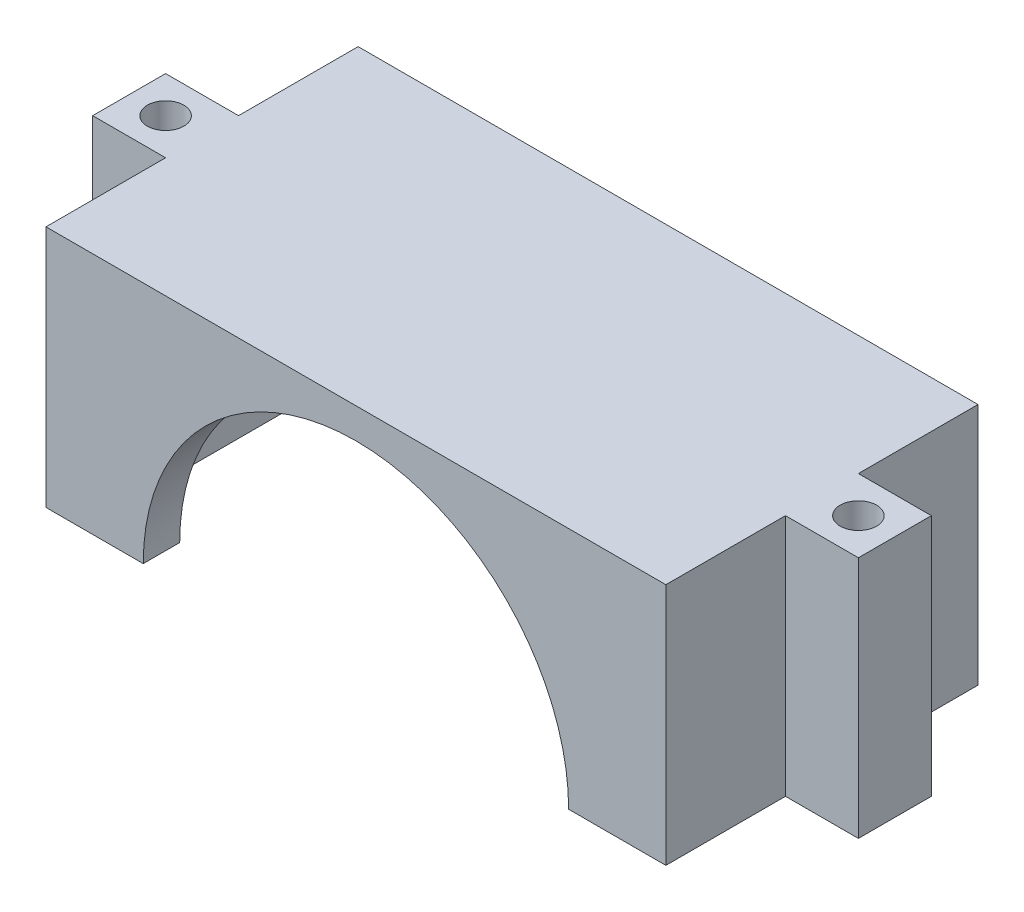
ISO-10303-21;
HEADER;
FILE_DESCRIPTION(('STEP AP214'),'2;1');
FILE_NAME('part.step','',(''),(''),'','','');
FILE_SCHEMA(('AUTOMOTIVE_DESIGN { 1 0 10303 214 1 1 1 1 }'));
ENDSEC;
DATA;
#1=APPLICATION_CONTEXT('core data for automotive mechanical design processes');
#2=APPLICATION_PROTOCOL_DEFINITION('international standard','automotive_design',2000,#1);
#3=PRODUCT_CONTEXT('',#1,'mechanical');
#4=PRODUCT('Part','Part','',(#3));
#5=PRODUCT_RELATED_PRODUCT_CATEGORY('part','',(#4));
#6=PRODUCT_DEFINITION_FORMATION('','',#4);
#7=PRODUCT_DEFINITION_CONTEXT('part definition',#1,'design');
#8=PRODUCT_DEFINITION('design','',#6,#7);
#9=PRODUCT_DEFINITION_SHAPE('','',#8);
#10=(LENGTH_UNIT() NAMED_UNIT(*) SI_UNIT(.MILLI.,.METRE.));
#11=(NAMED_UNIT(*) PLANE_ANGLE_UNIT() SI_UNIT($,.RADIAN.));
#12=(NAMED_UNIT(*) SI_UNIT($,.STERADIAN.) SOLID_ANGLE_UNIT());
#13=UNCERTAINTY_MEASURE_WITH_UNIT(LENGTH_MEASURE(1.E-05),#10,'distance_accuracy_value','');
#14=(GEOMETRIC_REPRESENTATION_CONTEXT(3) GLOBAL_UNCERTAINTY_ASSIGNED_CONTEXT((#13)) GLOBAL_UNIT_ASSIGNED_CONTEXT((#10,
#11,#12)) REPRESENTATION_CONTEXT('',''));
#15=CARTESIAN_POINT('',(0.,0.,0.));
#16=DIRECTION('',(0.,0.,1.));
#17=DIRECTION('',(1.,0.,0.));
#18=AXIS2_PLACEMENT_3D('',#15,#16,#17);
#19=CARTESIAN_POINT('',(-25.5,20.,12.84));
#20=DIRECTION('',(1.,0.,0.));
#21=DIRECTION('',(0.,0.,-1.));
#22=AXIS2_PLACEMENT_3D('',#19,#20,#21);
#23=PLANE('',#22);
#24=DIRECTION('',(0.,-1.,0.));
#25=VECTOR('',#24,1.);
#26=CARTESIAN_POINT('',(-25.5,20.,-3.00000000000001));
#27=LINE('',#26,#25);
#28=CARTESIAN_POINT('',(-25.5,20.,-3.00000000000001));
#29=VERTEX_POINT('',#28);
#30=CARTESIAN_POINT('',(-25.5,0.,-3.00000000000001));
#31=VERTEX_POINT('',#30);
#32=EDGE_CURVE('E303',#29,#31,#27,.T.);
#33=ORIENTED_EDGE('',*,*,#32,.F.);
#34=DIRECTION('',(0.,0.,1.));
#35=VECTOR('',#34,1.);
#36=CARTESIAN_POINT('',(-25.5,20.,12.84));
#37=LINE('',#36,#35);
#38=CARTESIAN_POINT('',(-25.5,20.,-12.84));
#39=VERTEX_POINT('',#38);
#40=EDGE_CURVE('E210',#39,#29,#37,.T.);
#41=ORIENTED_EDGE('',*,*,#40,.F.);
#42=DIRECTION('',(0.,-1.,0.));
#43=VECTOR('',#42,1.);
#44=CARTESIAN_POINT('',(-25.5,20.,-12.84));
#45=LINE('',#44,#43);
#46=CARTESIAN_POINT('',(-25.5,0.,-12.84));
#47=VERTEX_POINT('',#46);
#48=EDGE_CURVE('E41',#39,#47,#45,.T.);
#49=ORIENTED_EDGE('',*,*,#48,.T.);
#50=DIRECTION('',(0.,0.,1.));
#51=VECTOR('',#50,1.);
#52=CARTESIAN_POINT('',(-25.5,0.,12.84));
#53=LINE('',#52,#51);
#54=EDGE_CURVE('E254',#47,#31,#53,.T.);
#55=ORIENTED_EDGE('',*,*,#54,.T.);
#56=EDGE_LOOP('',(#33,#41,#49,#55));
#57=FACE_BOUND('',#56,.T.);
#58=ADVANCED_FACE('F32',(#57),#23,.F.);
#59=CARTESIAN_POINT('',(25.5,20.,12.84));
#60=DIRECTION('',(-1.,0.,0.));
#61=DIRECTION('',(0.,0.,1.));
#62=AXIS2_PLACEMENT_3D('',#59,#60,#61);
#63=PLANE('',#62);
#64=DIRECTION('',(0.,-1.,0.));
#65=VECTOR('',#64,1.);
#66=CARTESIAN_POINT('',(25.5,20.,3.));
#67=LINE('',#66,#65);
#68=CARTESIAN_POINT('',(25.5,20.,3.));
#69=VERTEX_POINT('',#68);
#70=CARTESIAN_POINT('',(25.5,0.,3.));
#71=VERTEX_POINT('',#70);
#72=EDGE_CURVE('E270',#69,#71,#67,.T.);
#73=ORIENTED_EDGE('',*,*,#72,.F.);
#74=DIRECTION('',(0.,0.,-1.));
#75=VECTOR('',#74,1.);
#76=CARTESIAN_POINT('',(25.5,20.,12.84));
#77=LINE('',#76,#75);
#78=CARTESIAN_POINT('',(25.5,20.,12.84));
#79=VERTEX_POINT('',#78);
#80=EDGE_CURVE('E216',#79,#69,#77,.T.);
#81=ORIENTED_EDGE('',*,*,#80,.F.);
#82=DIRECTION('',(0.,-1.,0.));
#83=VECTOR('',#82,1.);
#84=CARTESIAN_POINT('',(25.5,20.,12.84));
#85=LINE('',#84,#83);
#86=CARTESIAN_POINT('',(25.5,0.,12.84));
#87=VERTEX_POINT('',#86);
#88=EDGE_CURVE('E227',#79,#87,#85,.T.);
#89=ORIENTED_EDGE('',*,*,#88,.T.);
#90=DIRECTION('',(0.,0.,-1.));
#91=VECTOR('',#90,1.);
#92=CARTESIAN_POINT('',(25.5,0.,12.84));
#93=LINE('',#92,#91);
#94=EDGE_CURVE('E237',#87,#71,#93,.T.);
#95=ORIENTED_EDGE('',*,*,#94,.T.);
#96=EDGE_LOOP('',(#73,#81,#89,#95));
#97=FACE_BOUND('',#96,.T.);
#98=ADVANCED_FACE('F421',(#97),#63,.F.);
#99=CARTESIAN_POINT('',(0.,0.,0.));
#100=DIRECTION('',(0.,-1.,0.));
#101=DIRECTION('',(0.,0.,-1.));
#102=AXIS2_PLACEMENT_3D('',#99,#100,#101);
#103=PLANE('',#102);
#104=DIRECTION('',(0.,0.,-1.));
#105=VECTOR('',#104,1.);
#106=CARTESIAN_POINT('',(22.,0.,1.8219037896906));
#107=LINE('',#106,#105);
#108=CARTESIAN_POINT('',(22.,0.,-9.84));
#109=VERTEX_POINT('',#108);
#110=CARTESIAN_POINT('',(22.,0.,-12.84));
#111=VERTEX_POINT('',#110);
#112=EDGE_CURVE('E437',#109,#111,#107,.T.);
#113=ORIENTED_EDGE('',*,*,#112,.T.);
#114=DIRECTION('',(-1.,0.,0.));
#115=VECTOR('',#114,1.);
#116=CARTESIAN_POINT('',(-25.5,0.,-12.84));
#117=LINE('',#116,#115);
#118=CARTESIAN_POINT('',(25.5,0.,-12.84));
#119=VERTEX_POINT('',#118);
#120=EDGE_CURVE('E230',#119,#111,#117,.T.);
#121=ORIENTED_EDGE('',*,*,#120,.F.);
#122=CARTESIAN_POINT('',(25.5,0.,-3.));
#123=VERTEX_POINT('',#122);
#124=EDGE_CURVE('E234',#123,#119,#93,.T.);
#125=ORIENTED_EDGE('',*,*,#124,.F.);
#126=DIRECTION('',(1.,0.,0.));
#127=VECTOR('',#126,1.);
#128=CARTESIAN_POINT('',(25.5,0.,-3.));
#129=LINE('',#128,#127);
#130=CARTESIAN_POINT('',(31.5,0.,-3.));
#131=VERTEX_POINT('',#130);
#132=EDGE_CURVE('E57',#123,#131,#129,.T.);
#133=ORIENTED_EDGE('',*,*,#132,.T.);
#134=DIRECTION('',(0.,0.,1.));
#135=VECTOR('',#134,1.);
#136=CARTESIAN_POINT('',(31.5,0.,-3.));
#137=LINE('',#136,#135);
#138=CARTESIAN_POINT('',(31.5,0.,3.));
#139=VERTEX_POINT('',#138);
#140=EDGE_CURVE('E263',#131,#139,#137,.T.);
#141=ORIENTED_EDGE('',*,*,#140,.T.);
#142=DIRECTION('',(-1.,0.,0.));
#143=VECTOR('',#142,1.);
#144=CARTESIAN_POINT('',(25.5,0.,3.));
#145=LINE('',#144,#143);
#146=EDGE_CURVE('E259',#139,#71,#145,.T.);
#147=ORIENTED_EDGE('',*,*,#146,.T.);
#148=ORIENTED_EDGE('',*,*,#94,.F.);
#149=DIRECTION('',(1.,0.,0.));
#150=VECTOR('',#149,1.);
#151=CARTESIAN_POINT('',(-25.5,0.,12.84));
#152=LINE('',#151,#150);
#153=CARTESIAN_POINT('',(17.5,0.,12.84));
#154=VERTEX_POINT('',#153);
#155=EDGE_CURVE('E249',#154,#87,#152,.T.);
#156=ORIENTED_EDGE('',*,*,#155,.F.);
#157=DIRECTION('',(0.,0.,1.));
#158=VECTOR('',#157,1.);
#159=CARTESIAN_POINT('',(17.5,0.,-29.2911896062463));
#160=LINE('',#159,#158);
#161=CARTESIAN_POINT('',(17.5,0.,9.84));
#162=VERTEX_POINT('',#161);
#163=EDGE_CURVE('E372',#162,#154,#160,.T.);
#164=ORIENTED_EDGE('',*,*,#163,.F.);
#165=DIRECTION('',(-1.,0.,0.));
#166=VECTOR('',#165,1.);
#167=CARTESIAN_POINT('',(-22.5,0.,9.84));
#168=LINE('',#167,#166);
#169=CARTESIAN_POINT('',(22.5,0.,9.84));
#170=VERTEX_POINT('',#169);
#171=EDGE_CURVE('E398',#170,#162,#168,.T.);
#172=ORIENTED_EDGE('',*,*,#171,.F.);
#173=DIRECTION('',(0.,0.,1.));
#174=VECTOR('',#173,1.);
#175=CARTESIAN_POINT('',(22.5,0.,-9.84));
#176=LINE('',#175,#174);
#177=CARTESIAN_POINT('',(22.5,0.,-9.84));
#178=VERTEX_POINT('',#177);
#179=EDGE_CURVE('E395',#178,#170,#176,.T.);
#180=ORIENTED_EDGE('',*,*,#179,.F.);
#181=DIRECTION('',(1.,0.,0.));
#182=VECTOR('',#181,1.);
#183=CARTESIAN_POINT('',(-22.5,0.,-9.84));
#184=LINE('',#183,#182);
#185=EDGE_CURVE('E404',#109,#178,#184,.T.);
#186=ORIENTED_EDGE('',*,*,#185,.F.);
#187=EDGE_LOOP('',(#113,#121,#125,#133,#141,#147,#148,#156,#164,#172,#180,#186));
#188=FACE_BOUND('',#187,.T.);
#189=CARTESIAN_POINT('',(28.5,0.,0.));
#190=DIRECTION('',(0.,-1.,0.));
#191=DIRECTION('',(0.,0.,-1.));
#192=AXIS2_PLACEMENT_3D('',#189,#190,#191);
#193=CIRCLE('',#192,1.5);
#194=CARTESIAN_POINT('',(28.5,0.,-1.49999999999999));
#195=VERTEX_POINT('',#194);
#196=EDGE_CURVE('E299',#195,#195,#193,.T.);
#197=ORIENTED_EDGE('',*,*,#196,.F.);
#198=EDGE_LOOP('',(#197));
#199=FACE_BOUND('',#198,.T.);
#200=ADVANCED_FACE('F429',(#188,#199),#103,.T.);
#201=CARTESIAN_POINT('',(-22.5,17.5,9.84));
#202=DIRECTION('',(0.,0.,1.));
#203=DIRECTION('',(1.,0.,0.));
#204=AXIS2_PLACEMENT_3D('',#201,#202,#203);
#205=PLANE('',#204);
#206=ORIENTED_EDGE('',*,*,#171,.T.);
#207=CARTESIAN_POINT('',(0.,0.,9.84));
#208=DIRECTION('',(0.,0.,1.));
#209=DIRECTION('',(1.,0.,0.));
#210=AXIS2_PLACEMENT_3D('',#207,#208,#209);
#211=CIRCLE('',#210,17.5);
#212=CARTESIAN_POINT('',(0.,17.5,9.84));
#213=VERTEX_POINT('',#212);
#214=EDGE_CURVE('E375',#213,#162,#211,.F.);
#215=ORIENTED_EDGE('',*,*,#214,.F.);
#216=DIRECTION('',(-1.,0.,0.));
#217=VECTOR('',#216,1.);
#218=CARTESIAN_POINT('',(-22.5,17.5,9.84));
#219=LINE('',#218,#217);
#220=CARTESIAN_POINT('',(22.5,17.5,9.84));
#221=VERTEX_POINT('',#220);
#222=EDGE_CURVE('E385',#221,#213,#219,.T.);
#223=ORIENTED_EDGE('',*,*,#222,.F.);
#224=DIRECTION('',(0.,-1.,0.));
#225=VECTOR('',#224,1.);
#226=CARTESIAN_POINT('',(22.5,17.5,9.84));
#227=LINE('',#226,#225);
#228=EDGE_CURVE('E394',#221,#170,#227,.T.);
#229=ORIENTED_EDGE('',*,*,#228,.T.);
#230=EDGE_LOOP('',(#206,#215,#223,#229));
#231=FACE_BOUND('',#230,.T.);
#232=ADVANCED_FACE('F457',(#231),#205,.F.);
#233=CARTESIAN_POINT('',(25.5,20.,-3.));
#234=VERTEX_POINT('',#233);
#235=CARTESIAN_POINT('',(25.5,20.,-12.84));
#236=VERTEX_POINT('',#235);
#237=EDGE_CURVE('E248',#234,#236,#77,.T.);
#238=ORIENTED_EDGE('',*,*,#237,.F.);
#239=DIRECTION('',(0.,-1.,0.));
#240=VECTOR('',#239,1.);
#241=CARTESIAN_POINT('',(25.5,20.,-3.));
#242=LINE('',#241,#240);
#243=EDGE_CURVE('E268',#234,#123,#242,.T.);
#244=ORIENTED_EDGE('',*,*,#243,.T.);
#245=ORIENTED_EDGE('',*,*,#124,.T.);
#246=DIRECTION('',(0.,-1.,0.));
#247=VECTOR('',#246,1.);
#248=CARTESIAN_POINT('',(25.5,20.,-12.84));
#249=LINE('',#248,#247);
#250=EDGE_CURVE('E11',#236,#119,#249,.T.);
#251=ORIENTED_EDGE('',*,*,#250,.F.);
#252=EDGE_LOOP('',(#238,#244,#245,#251));
#253=FACE_BOUND('',#252,.T.);
#254=ADVANCED_FACE('F34',(#253),#63,.F.);
#255=CARTESIAN_POINT('',(-25.5,20.,-12.84));
#256=DIRECTION('',(0.,0.,1.));
#257=DIRECTION('',(1.,0.,0.));
#258=AXIS2_PLACEMENT_3D('',#255,#256,#257);
#259=PLANE('',#258);
#260=ORIENTED_EDGE('',*,*,#120,.T.);
#261=DIRECTION('',(0.,-1.,0.));
#262=VECTOR('',#261,1.);
#263=CARTESIAN_POINT('',(22.,0.,-12.84));
#264=LINE('',#263,#262);
#265=CARTESIAN_POINT('',(22.,6.,-12.84));
#266=VERTEX_POINT('',#265);
#267=EDGE_CURVE('E273',#266,#111,#264,.T.);
#268=ORIENTED_EDGE('',*,*,#267,.F.);
#269=DIRECTION('',(1.,0.,0.));
#270=VECTOR('',#269,1.);
#271=CARTESIAN_POINT('',(22.,6.,-12.84));
#272=LINE('',#271,#270);
#273=CARTESIAN_POINT('',(12.,6.,-12.84));
#274=VERTEX_POINT('',#273);
#275=EDGE_CURVE('E441',#274,#266,#272,.T.);
#276=ORIENTED_EDGE('',*,*,#275,.F.);
#277=DIRECTION('',(0.,1.,0.));
#278=VECTOR('',#277,1.);
#279=CARTESIAN_POINT('',(12.,0.,-12.84));
#280=LINE('',#279,#278);
#281=CARTESIAN_POINT('',(12.,0.,-12.84));
#282=VERTEX_POINT('',#281);
#283=EDGE_CURVE('E446',#282,#274,#280,.T.);
#284=ORIENTED_EDGE('',*,*,#283,.F.);
#285=EDGE_CURVE('E239',#282,#47,#117,.T.);
#286=ORIENTED_EDGE('',*,*,#285,.T.);
#287=ORIENTED_EDGE('',*,*,#48,.F.);
#288=DIRECTION('',(-1.,0.,0.));
#289=VECTOR('',#288,1.);
#290=CARTESIAN_POINT('',(-25.5,20.,-12.84));
#291=LINE('',#290,#289);
#292=EDGE_CURVE('E211',#236,#39,#291,.T.);
#293=ORIENTED_EDGE('',*,*,#292,.F.);
#294=ORIENTED_EDGE('',*,*,#250,.T.);
#295=EDGE_LOOP('',(#260,#268,#276,#284,#286,#287,#293,#294));
#296=FACE_BOUND('',#295,.T.);
#297=ADVANCED_FACE('F352',(#296),#259,.F.);
#298=CARTESIAN_POINT('',(-25.5,20.,2.99999999999999));
#299=VERTEX_POINT('',#298);
#300=CARTESIAN_POINT('',(-25.5,20.,12.84));
#301=VERTEX_POINT('',#300);
#302=EDGE_CURVE('E199',#299,#301,#37,.T.);
#303=ORIENTED_EDGE('',*,*,#302,.F.);
#304=DIRECTION('',(0.,-1.,0.));
#305=VECTOR('',#304,1.);
#306=CARTESIAN_POINT('',(-25.5,20.,2.99999999999999));
#307=LINE('',#306,#305);
#308=CARTESIAN_POINT('',(-25.5,0.,2.99999999999999));
#309=VERTEX_POINT('',#308);
#310=EDGE_CURVE('E184',#299,#309,#307,.T.);
#311=ORIENTED_EDGE('',*,*,#310,.T.);
#312=CARTESIAN_POINT('',(-25.5,0.,12.84));
#313=VERTEX_POINT('',#312);
#314=EDGE_CURVE('E252',#309,#313,#53,.T.);
#315=ORIENTED_EDGE('',*,*,#314,.T.);
#316=DIRECTION('',(0.,-1.,0.));
#317=VECTOR('',#316,1.);
#318=CARTESIAN_POINT('',(-25.5,20.,12.84));
#319=LINE('',#318,#317);
#320=EDGE_CURVE('E208',#301,#313,#319,.T.);
#321=ORIENTED_EDGE('',*,*,#320,.F.);
#322=EDGE_LOOP('',(#303,#311,#315,#321));
#323=FACE_BOUND('',#322,.T.);
#324=ADVANCED_FACE('F206',(#323),#23,.F.);
#325=CARTESIAN_POINT('',(-25.5,20.,12.84));
#326=DIRECTION('',(0.,0.,-1.));
#327=DIRECTION('',(-1.,0.,0.));
#328=AXIS2_PLACEMENT_3D('',#325,#326,#327);
#329=PLANE('',#328);
#330=CARTESIAN_POINT('',(-17.5,0.,12.84));
#331=VERTEX_POINT('',#330);
#332=EDGE_CURVE('E246',#313,#331,#152,.T.);
#333=ORIENTED_EDGE('',*,*,#332,.T.);
#334=CARTESIAN_POINT('',(0.,0.,12.84));
#335=DIRECTION('',(0.,0.,1.));
#336=DIRECTION('',(1.,0.,0.));
#337=AXIS2_PLACEMENT_3D('',#334,#335,#336);
#338=CIRCLE('',#337,17.5);
#339=EDGE_CURVE('E373',#154,#331,#338,.T.);
#340=ORIENTED_EDGE('',*,*,#339,.F.);
#341=ORIENTED_EDGE('',*,*,#155,.T.);
#342=ORIENTED_EDGE('',*,*,#88,.F.);
#343=DIRECTION('',(1.,0.,0.));
#344=VECTOR('',#343,1.);
#345=CARTESIAN_POINT('',(-25.5,20.,12.84));
#346=LINE('',#345,#344);
#347=EDGE_CURVE('E214',#301,#79,#346,.T.);
#348=ORIENTED_EDGE('',*,*,#347,.F.);
#349=ORIENTED_EDGE('',*,*,#320,.T.);
#350=EDGE_LOOP('',(#333,#340,#341,#342,#348,#349));
#351=FACE_BOUND('',#350,.T.);
#352=ADVANCED_FACE('F362',(#351),#329,.F.);
#353=CARTESIAN_POINT('',(0.,20.,0.));
#354=DIRECTION('',(0.,-1.,0.));
#355=DIRECTION('',(0.,0.,-1.));
#356=AXIS2_PLACEMENT_3D('',#353,#354,#355);
#357=PLANE('',#356);
#358=ORIENTED_EDGE('',*,*,#80,.T.);
#359=DIRECTION('',(-1.,0.,0.));
#360=VECTOR('',#359,1.);
#361=CARTESIAN_POINT('',(25.5,20.,3.));
#362=LINE('',#361,#360);
#363=CARTESIAN_POINT('',(31.5,20.,3.));
#364=VERTEX_POINT('',#363);
#365=EDGE_CURVE('E266',#364,#69,#362,.T.);
#366=ORIENTED_EDGE('',*,*,#365,.F.);
#367=DIRECTION('',(0.,0.,1.));
#368=VECTOR('',#367,1.);
#369=CARTESIAN_POINT('',(31.5,20.,-3.));
#370=LINE('',#369,#368);
#371=CARTESIAN_POINT('',(31.5,20.,-3.));
#372=VERTEX_POINT('',#371);
#373=EDGE_CURVE('E269',#372,#364,#370,.T.);
#374=ORIENTED_EDGE('',*,*,#373,.F.);
#375=DIRECTION('',(1.,0.,0.));
#376=VECTOR('',#375,1.);
#377=CARTESIAN_POINT('',(25.5,20.,-3.));
#378=LINE('',#377,#376);
#379=EDGE_CURVE('E262',#234,#372,#378,.T.);
#380=ORIENTED_EDGE('',*,*,#379,.F.);
#381=ORIENTED_EDGE('',*,*,#237,.T.);
#382=ORIENTED_EDGE('',*,*,#292,.T.);
#383=ORIENTED_EDGE('',*,*,#40,.T.);
#384=DIRECTION('',(1.,0.,0.));
#385=VECTOR('',#384,1.);
#386=CARTESIAN_POINT('',(-25.5,20.,-3.00000000000001));
#387=LINE('',#386,#385);
#388=CARTESIAN_POINT('',(-31.5,20.,-3.00000000000001));
#389=VERTEX_POINT('',#388);
#390=EDGE_CURVE('E192',#389,#29,#387,.T.);
#391=ORIENTED_EDGE('',*,*,#390,.F.);
#392=DIRECTION('',(0.,0.,-1.));
#393=VECTOR('',#392,1.);
#394=CARTESIAN_POINT('',(-31.5,20.,-3.00000000000001));
#395=LINE('',#394,#393);
#396=CARTESIAN_POINT('',(-31.5,20.,2.99999999999999));
#397=VERTEX_POINT('',#396);
#398=EDGE_CURVE('E203',#397,#389,#395,.T.);
#399=ORIENTED_EDGE('',*,*,#398,.F.);
#400=DIRECTION('',(-1.,0.,0.));
#401=VECTOR('',#400,1.);
#402=CARTESIAN_POINT('',(-25.5,20.,2.99999999999999));
#403=LINE('',#402,#401);
#404=EDGE_CURVE('E187',#299,#397,#403,.T.);
#405=ORIENTED_EDGE('',*,*,#404,.F.);
#406=ORIENTED_EDGE('',*,*,#302,.T.);
#407=ORIENTED_EDGE('',*,*,#347,.T.);
#408=EDGE_LOOP('',(#358,#366,#374,#380,#381,#382,#383,#391,#399,#405,#406,#407));
#409=FACE_BOUND('',#408,.T.);
#410=CARTESIAN_POINT('',(28.5,20.,0.));
#411=DIRECTION('',(0.,-1.,0.));
#412=DIRECTION('',(0.,0.,-1.));
#413=AXIS2_PLACEMENT_3D('',#410,#411,#412);
#414=CIRCLE('',#413,1.5);
#415=CARTESIAN_POINT('',(28.5,20.,-1.49999999999999));
#416=VERTEX_POINT('',#415);
#417=EDGE_CURVE('E302',#416,#416,#414,.T.);
#418=ORIENTED_EDGE('',*,*,#417,.T.);
#419=EDGE_LOOP('',(#418));
#420=FACE_BOUND('',#419,.T.);
#421=CARTESIAN_POINT('',(-28.5,20.,0.));
#422=DIRECTION('',(0.,-1.,0.));
#423=DIRECTION('',(0.,0.,1.));
#424=AXIS2_PLACEMENT_3D('',#421,#422,#423);
#425=CIRCLE('',#424,1.5);
#426=CARTESIAN_POINT('',(-28.5,20.,1.5));
#427=VERTEX_POINT('',#426);
#428=EDGE_CURVE('E332',#427,#427,#425,.T.);
#429=ORIENTED_EDGE('',*,*,#428,.T.);
#430=EDGE_LOOP('',(#429));
#431=FACE_BOUND('',#430,.T.);
#432=ADVANCED_FACE('F197',(#409,#420,#431),#357,.F.);
#433=DIRECTION('',(0.,0.,-1.));
#434=VECTOR('',#433,1.);
#435=CARTESIAN_POINT('',(12.,0.,1.8219037896906));
#436=LINE('',#435,#434);
#437=CARTESIAN_POINT('',(12.,0.,-9.84));
#438=VERTEX_POINT('',#437);
#439=EDGE_CURVE('E357',#438,#282,#436,.T.);
#440=ORIENTED_EDGE('',*,*,#439,.F.);
#441=CARTESIAN_POINT('',(-22.5,0.,-9.84));
#442=VERTEX_POINT('',#441);
#443=EDGE_CURVE('E384',#442,#438,#184,.T.);
#444=ORIENTED_EDGE('',*,*,#443,.F.);
#445=DIRECTION('',(0.,0.,-1.));
#446=VECTOR('',#445,1.);
#447=CARTESIAN_POINT('',(-22.5,0.,-9.84));
#448=LINE('',#447,#446);
#449=CARTESIAN_POINT('',(-22.5,0.,9.84));
#450=VERTEX_POINT('',#449);
#451=EDGE_CURVE('E401',#450,#442,#448,.T.);
#452=ORIENTED_EDGE('',*,*,#451,.F.);
#453=CARTESIAN_POINT('',(-17.5,0.,9.84));
#454=VERTEX_POINT('',#453);
#455=EDGE_CURVE('E369',#454,#450,#168,.T.);
#456=ORIENTED_EDGE('',*,*,#455,.F.);
#457=DIRECTION('',(0.,0.,1.));
#458=VECTOR('',#457,1.);
#459=CARTESIAN_POINT('',(-17.5,0.,-29.2911896062463));
#460=LINE('',#459,#458);
#461=EDGE_CURVE('E367',#454,#331,#460,.T.);
#462=ORIENTED_EDGE('',*,*,#461,.T.);
#463=ORIENTED_EDGE('',*,*,#332,.F.);
#464=ORIENTED_EDGE('',*,*,#314,.F.);
#465=DIRECTION('',(-1.,0.,0.));
#466=VECTOR('',#465,1.);
#467=CARTESIAN_POINT('',(-25.5,0.,2.99999999999999));
#468=LINE('',#467,#466);
#469=CARTESIAN_POINT('',(-31.5,0.,2.99999999999999));
#470=VERTEX_POINT('',#469);
#471=EDGE_CURVE('E49',#309,#470,#468,.T.);
#472=ORIENTED_EDGE('',*,*,#471,.T.);
#473=DIRECTION('',(0.,0.,-1.));
#474=VECTOR('',#473,1.);
#475=CARTESIAN_POINT('',(-31.5,0.,-3.00000000000001));
#476=LINE('',#475,#474);
#477=CARTESIAN_POINT('',(-31.5,0.,-3.00000000000001));
#478=VERTEX_POINT('',#477);
#479=EDGE_CURVE('E319',#470,#478,#476,.T.);
#480=ORIENTED_EDGE('',*,*,#479,.T.);
#481=DIRECTION('',(1.,0.,0.));
#482=VECTOR('',#481,1.);
#483=CARTESIAN_POINT('',(-25.5,0.,-3.00000000000001));
#484=LINE('',#483,#482);
#485=EDGE_CURVE('E204',#478,#31,#484,.T.);
#486=ORIENTED_EDGE('',*,*,#485,.T.);
#487=ORIENTED_EDGE('',*,*,#54,.F.);
#488=ORIENTED_EDGE('',*,*,#285,.F.);
#489=EDGE_LOOP('',(#440,#444,#452,#456,#462,#463,#464,#472,#480,#486,#487,#488));
#490=FACE_BOUND('',#489,.T.);
#491=CARTESIAN_POINT('',(-28.5,0.,0.));
#492=DIRECTION('',(0.,-1.,0.));
#493=DIRECTION('',(0.,0.,1.));
#494=AXIS2_PLACEMENT_3D('',#491,#492,#493);
#495=CIRCLE('',#494,1.5);
#496=CARTESIAN_POINT('',(-28.5,0.,1.5));
#497=VERTEX_POINT('',#496);
#498=EDGE_CURVE('E334',#497,#497,#495,.T.);
#499=ORIENTED_EDGE('',*,*,#498,.F.);
#500=EDGE_LOOP('',(#499));
#501=FACE_BOUND('',#500,.T.);
#502=ADVANCED_FACE('F329',(#490,#501),#103,.T.);
#503=CARTESIAN_POINT('',(22.5,17.5,-9.84));
#504=DIRECTION('',(1.,0.,0.));
#505=DIRECTION('',(0.,0.,-1.));
#506=AXIS2_PLACEMENT_3D('',#503,#504,#505);
#507=PLANE('',#506);
#508=ORIENTED_EDGE('',*,*,#179,.T.);
#509=ORIENTED_EDGE('',*,*,#228,.F.);
#510=DIRECTION('',(0.,0.,1.));
#511=VECTOR('',#510,1.);
#512=CARTESIAN_POINT('',(22.5,17.5,-9.84));
#513=LINE('',#512,#511);
#514=CARTESIAN_POINT('',(22.5,17.5,-9.84));
#515=VERTEX_POINT('',#514);
#516=EDGE_CURVE('E380',#515,#221,#513,.T.);
#517=ORIENTED_EDGE('',*,*,#516,.F.);
#518=DIRECTION('',(0.,-1.,0.));
#519=VECTOR('',#518,1.);
#520=CARTESIAN_POINT('',(22.5,17.5,-9.84));
#521=LINE('',#520,#519);
#522=EDGE_CURVE('E406',#515,#178,#521,.T.);
#523=ORIENTED_EDGE('',*,*,#522,.T.);
#524=EDGE_LOOP('',(#508,#509,#517,#523));
#525=FACE_BOUND('',#524,.T.);
#526=ADVANCED_FACE('F460',(#525),#507,.F.);
#527=CARTESIAN_POINT('',(-22.5,17.5,-9.84));
#528=DIRECTION('',(0.,0.,-1.));
#529=DIRECTION('',(-1.,0.,0.));
#530=AXIS2_PLACEMENT_3D('',#527,#528,#529);
#531=PLANE('',#530);
#532=DIRECTION('',(-1.,0.,0.));
#533=VECTOR('',#532,1.);
#534=CARTESIAN_POINT('',(22.,6.,-9.84));
#535=LINE('',#534,#533);
#536=CARTESIAN_POINT('',(22.,6.,-9.84));
#537=VERTEX_POINT('',#536);
#538=CARTESIAN_POINT('',(12.,6.,-9.84));
#539=VERTEX_POINT('',#538);
#540=EDGE_CURVE('E467',#537,#539,#535,.T.);
#541=ORIENTED_EDGE('',*,*,#540,.F.);
#542=DIRECTION('',(0.,1.,0.));
#543=VECTOR('',#542,1.);
#544=CARTESIAN_POINT('',(22.,0.,-9.84));
#545=LINE('',#544,#543);
#546=EDGE_CURVE('E377',#109,#537,#545,.T.);
#547=ORIENTED_EDGE('',*,*,#546,.F.);
#548=ORIENTED_EDGE('',*,*,#185,.T.);
#549=ORIENTED_EDGE('',*,*,#522,.F.);
#550=DIRECTION('',(1.,0.,0.));
#551=VECTOR('',#550,1.);
#552=CARTESIAN_POINT('',(-22.5,17.5,-9.84));
#553=LINE('',#552,#551);
#554=CARTESIAN_POINT('',(-22.5,17.5,-9.84));
#555=VERTEX_POINT('',#554);
#556=EDGE_CURVE('E391',#555,#515,#553,.T.);
#557=ORIENTED_EDGE('',*,*,#556,.F.);
#558=DIRECTION('',(0.,-1.,0.));
#559=VECTOR('',#558,1.);
#560=CARTESIAN_POINT('',(-22.5,17.5,-9.84));
#561=LINE('',#560,#559);
#562=EDGE_CURVE('E409',#555,#442,#561,.T.);
#563=ORIENTED_EDGE('',*,*,#562,.T.);
#564=ORIENTED_EDGE('',*,*,#443,.T.);
#565=DIRECTION('',(0.,-1.,0.));
#566=VECTOR('',#565,1.);
#567=CARTESIAN_POINT('',(12.,0.,-9.84));
#568=LINE('',#567,#566);
#569=EDGE_CURVE('E286',#539,#438,#568,.T.);
#570=ORIENTED_EDGE('',*,*,#569,.F.);
#571=EDGE_LOOP('',(#541,#547,#548,#549,#557,#563,#564,#570));
#572=FACE_BOUND('',#571,.T.);
#573=ADVANCED_FACE('F464',(#572),#531,.F.);
#574=CARTESIAN_POINT('',(-22.5,17.5,-9.84));
#575=DIRECTION('',(-1.,0.,0.));
#576=DIRECTION('',(0.,0.,1.));
#577=AXIS2_PLACEMENT_3D('',#574,#575,#576);
#578=PLANE('',#577);
#579=ORIENTED_EDGE('',*,*,#451,.T.);
#580=ORIENTED_EDGE('',*,*,#562,.F.);
#581=DIRECTION('',(0.,0.,-1.));
#582=VECTOR('',#581,1.);
#583=CARTESIAN_POINT('',(-22.5,17.5,-9.84));
#584=LINE('',#583,#582);
#585=CARTESIAN_POINT('',(-22.5,17.5,9.84));
#586=VERTEX_POINT('',#585);
#587=EDGE_CURVE('E388',#586,#555,#584,.T.);
#588=ORIENTED_EDGE('',*,*,#587,.F.);
#589=DIRECTION('',(0.,-1.,0.));
#590=VECTOR('',#589,1.);
#591=CARTESIAN_POINT('',(-22.5,17.5,9.84));
#592=LINE('',#591,#590);
#593=EDGE_CURVE('E411',#586,#450,#592,.T.);
#594=ORIENTED_EDGE('',*,*,#593,.T.);
#595=EDGE_LOOP('',(#579,#580,#588,#594));
#596=FACE_BOUND('',#595,.T.);
#597=ADVANCED_FACE('F517',(#596),#578,.F.);
#598=EDGE_CURVE('E383',#213,#586,#219,.T.);
#599=ORIENTED_EDGE('',*,*,#598,.F.);
#600=EDGE_CURVE('E397',#454,#213,#211,.F.);
#601=ORIENTED_EDGE('',*,*,#600,.F.);
#602=ORIENTED_EDGE('',*,*,#455,.T.);
#603=ORIENTED_EDGE('',*,*,#593,.F.);
#604=EDGE_LOOP('',(#599,#601,#602,#603));
#605=FACE_BOUND('',#604,.T.);
#606=ADVANCED_FACE('F509',(#605),#205,.F.);
#607=CARTESIAN_POINT('',(0.,17.5,0.));
#608=DIRECTION('',(0.,1.,0.));
#609=DIRECTION('',(0.,0.,1.));
#610=AXIS2_PLACEMENT_3D('',#607,#608,#609);
#611=PLANE('',#610);
#612=ORIENTED_EDGE('',*,*,#516,.T.);
#613=ORIENTED_EDGE('',*,*,#222,.T.);
#614=ORIENTED_EDGE('',*,*,#598,.T.);
#615=ORIENTED_EDGE('',*,*,#587,.T.);
#616=ORIENTED_EDGE('',*,*,#556,.T.);
#617=EDGE_LOOP('',(#612,#613,#614,#615,#616));
#618=FACE_BOUND('',#617,.T.);
#619=ADVANCED_FACE('F488',(#618),#611,.F.);
#620=CARTESIAN_POINT('',(0.,0.,-29.2911896062463));
#621=DIRECTION('',(0.,0.,1.));
#622=DIRECTION('',(1.,0.,0.));
#623=AXIS2_PLACEMENT_3D('',#620,#621,#622);
#624=CYLINDRICAL_SURFACE('',#623,17.5);
#625=ORIENTED_EDGE('',*,*,#600,.T.);
#626=ORIENTED_EDGE('',*,*,#214,.T.);
#627=ORIENTED_EDGE('',*,*,#163,.T.);
#628=ORIENTED_EDGE('',*,*,#339,.T.);
#629=ORIENTED_EDGE('',*,*,#461,.F.);
#630=EDGE_LOOP('',(#625,#626,#627,#628,#629));
#631=FACE_BOUND('',#630,.T.);
#632=ADVANCED_FACE('F452',(#631),#624,.F.);
#633=CARTESIAN_POINT('',(22.,0.,1.8219037896906));
#634=DIRECTION('',(1.,0.,0.));
#635=DIRECTION('',(0.,0.,-1.));
#636=AXIS2_PLACEMENT_3D('',#633,#634,#635);
#637=PLANE('',#636);
#638=ORIENTED_EDGE('',*,*,#546,.T.);
#639=DIRECTION('',(0.,0.,-1.));
#640=VECTOR('',#639,1.);
#641=CARTESIAN_POINT('',(22.,6.,1.8219037896906));
#642=LINE('',#641,#640);
#643=EDGE_CURVE('E474',#537,#266,#642,.T.);
#644=ORIENTED_EDGE('',*,*,#643,.T.);
#645=ORIENTED_EDGE('',*,*,#267,.T.);
#646=ORIENTED_EDGE('',*,*,#112,.F.);
#647=EDGE_LOOP('',(#638,#644,#645,#646));
#648=FACE_BOUND('',#647,.T.);
#649=ADVANCED_FACE('F480',(#648),#637,.F.);
#650=CARTESIAN_POINT('',(22.,6.,1.8219037896906));
#651=DIRECTION('',(0.,1.,0.));
#652=DIRECTION('',(0.,0.,1.));
#653=AXIS2_PLACEMENT_3D('',#650,#651,#652);
#654=PLANE('',#653);
#655=ORIENTED_EDGE('',*,*,#540,.T.);
#656=DIRECTION('',(0.,0.,-1.));
#657=VECTOR('',#656,1.);
#658=CARTESIAN_POINT('',(12.,6.,1.8219037896906));
#659=LINE('',#658,#657);
#660=EDGE_CURVE('E443',#539,#274,#659,.T.);
#661=ORIENTED_EDGE('',*,*,#660,.T.);
#662=ORIENTED_EDGE('',*,*,#275,.T.);
#663=ORIENTED_EDGE('',*,*,#643,.F.);
#664=EDGE_LOOP('',(#655,#661,#662,#663));
#665=FACE_BOUND('',#664,.T.);
#666=ADVANCED_FACE('F476',(#665),#654,.F.);
#667=CARTESIAN_POINT('',(12.,0.,1.8219037896906));
#668=DIRECTION('',(-1.,0.,0.));
#669=DIRECTION('',(0.,0.,1.));
#670=AXIS2_PLACEMENT_3D('',#667,#668,#669);
#671=PLANE('',#670);
#672=ORIENTED_EDGE('',*,*,#569,.T.);
#673=ORIENTED_EDGE('',*,*,#439,.T.);
#674=ORIENTED_EDGE('',*,*,#283,.T.);
#675=ORIENTED_EDGE('',*,*,#660,.F.);
#676=EDGE_LOOP('',(#672,#673,#674,#675));
#677=FACE_BOUND('',#676,.T.);
#678=ADVANCED_FACE('F479',(#677),#671,.F.);
#679=CARTESIAN_POINT('',(25.5,20.,3.));
#680=DIRECTION('',(0.,0.,1.));
#681=DIRECTION('',(1.,0.,0.));
#682=AXIS2_PLACEMENT_3D('',#679,#680,#681);
#683=PLANE('',#682);
#684=ORIENTED_EDGE('',*,*,#146,.F.);
#685=DIRECTION('',(0.,-1.,0.));
#686=VECTOR('',#685,1.);
#687=CARTESIAN_POINT('',(31.5,20.,3.));
#688=LINE('',#687,#686);
#689=EDGE_CURVE('E274',#364,#139,#688,.T.);
#690=ORIENTED_EDGE('',*,*,#689,.F.);
#691=ORIENTED_EDGE('',*,*,#365,.T.);
#692=ORIENTED_EDGE('',*,*,#72,.T.);
#693=EDGE_LOOP('',(#684,#690,#691,#692));
#694=FACE_BOUND('',#693,.T.);
#695=ADVANCED_FACE('F425',(#694),#683,.T.);
#696=CARTESIAN_POINT('',(31.5,20.,-3.));
#697=DIRECTION('',(1.,0.,0.));
#698=DIRECTION('',(0.,0.,-1.));
#699=AXIS2_PLACEMENT_3D('',#696,#697,#698);
#700=PLANE('',#699);
#701=ORIENTED_EDGE('',*,*,#140,.F.);
#702=DIRECTION('',(0.,-1.,0.));
#703=VECTOR('',#702,1.);
#704=CARTESIAN_POINT('',(31.5,20.,-3.));
#705=LINE('',#704,#703);
#706=EDGE_CURVE('E282',#372,#131,#705,.T.);
#707=ORIENTED_EDGE('',*,*,#706,.F.);
#708=ORIENTED_EDGE('',*,*,#373,.T.);
#709=ORIENTED_EDGE('',*,*,#689,.T.);
#710=EDGE_LOOP('',(#701,#707,#708,#709));
#711=FACE_BOUND('',#710,.T.);
#712=ADVANCED_FACE('F434',(#711),#700,.T.);
#713=CARTESIAN_POINT('',(25.5,20.,-3.));
#714=DIRECTION('',(0.,0.,-1.));
#715=DIRECTION('',(-1.,0.,0.));
#716=AXIS2_PLACEMENT_3D('',#713,#714,#715);
#717=PLANE('',#716);
#718=ORIENTED_EDGE('',*,*,#132,.F.);
#719=ORIENTED_EDGE('',*,*,#243,.F.);
#720=ORIENTED_EDGE('',*,*,#379,.T.);
#721=ORIENTED_EDGE('',*,*,#706,.T.);
#722=EDGE_LOOP('',(#718,#719,#720,#721));
#723=FACE_BOUND('',#722,.T.);
#724=ADVANCED_FACE('F567',(#723),#717,.T.);
#725=CARTESIAN_POINT('',(28.5,20.,0.));
#726=DIRECTION('',(0.,-1.,0.));
#727=DIRECTION('',(0.,0.,-1.));
#728=AXIS2_PLACEMENT_3D('',#725,#726,#727);
#729=CYLINDRICAL_SURFACE('',#728,1.5);
#730=ORIENTED_EDGE('',*,*,#417,.F.);
#731=EDGE_LOOP('',(#730));
#732=FACE_BOUND('',#731,.T.);
#733=ORIENTED_EDGE('',*,*,#196,.T.);
#734=EDGE_LOOP('',(#733));
#735=FACE_BOUND('',#734,.T.);
#736=ADVANCED_FACE('F576',(#732,#735),#729,.F.);
#737=CARTESIAN_POINT('',(-25.5,20.,-3.00000000000001));
#738=DIRECTION('',(0.,0.,-1.));
#739=DIRECTION('',(-1.,0.,0.));
#740=AXIS2_PLACEMENT_3D('',#737,#738,#739);
#741=PLANE('',#740);
#742=ORIENTED_EDGE('',*,*,#485,.F.);
#743=DIRECTION('',(0.,-1.,0.));
#744=VECTOR('',#743,1.);
#745=CARTESIAN_POINT('',(-31.5,20.,-3.00000000000001));
#746=LINE('',#745,#744);
#747=EDGE_CURVE('E315',#389,#478,#746,.T.);
#748=ORIENTED_EDGE('',*,*,#747,.F.);
#749=ORIENTED_EDGE('',*,*,#390,.T.);
#750=ORIENTED_EDGE('',*,*,#32,.T.);
#751=EDGE_LOOP('',(#742,#748,#749,#750));
#752=FACE_BOUND('',#751,.T.);
#753=ADVANCED_FACE('F342',(#752),#741,.T.);
#754=CARTESIAN_POINT('',(-31.5,20.,-3.00000000000001));
#755=DIRECTION('',(-1.,0.,0.));
#756=DIRECTION('',(0.,0.,1.));
#757=AXIS2_PLACEMENT_3D('',#754,#755,#756);
#758=PLANE('',#757);
#759=ORIENTED_EDGE('',*,*,#479,.F.);
#760=DIRECTION('',(0.,-1.,0.));
#761=VECTOR('',#760,1.);
#762=CARTESIAN_POINT('',(-31.5,20.,2.99999999999999));
#763=LINE('',#762,#761);
#764=EDGE_CURVE('E191',#397,#470,#763,.T.);
#765=ORIENTED_EDGE('',*,*,#764,.F.);
#766=ORIENTED_EDGE('',*,*,#398,.T.);
#767=ORIENTED_EDGE('',*,*,#747,.T.);
#768=EDGE_LOOP('',(#759,#765,#766,#767));
#769=FACE_BOUND('',#768,.T.);
#770=ADVANCED_FACE('F324',(#769),#758,.T.);
#771=CARTESIAN_POINT('',(-25.5,20.,2.99999999999999));
#772=DIRECTION('',(0.,0.,1.));
#773=DIRECTION('',(1.,0.,0.));
#774=AXIS2_PLACEMENT_3D('',#771,#772,#773);
#775=PLANE('',#774);
#776=ORIENTED_EDGE('',*,*,#471,.F.);
#777=ORIENTED_EDGE('',*,*,#310,.F.);
#778=ORIENTED_EDGE('',*,*,#404,.T.);
#779=ORIENTED_EDGE('',*,*,#764,.T.);
#780=EDGE_LOOP('',(#776,#777,#778,#779));
#781=FACE_BOUND('',#780,.T.);
#782=ADVANCED_FACE('F186',(#781),#775,.T.);
#783=CARTESIAN_POINT('',(-28.5,20.,0.));
#784=DIRECTION('',(0.,-1.,0.));
#785=DIRECTION('',(0.,0.,-1.));
#786=AXIS2_PLACEMENT_3D('',#783,#784,#785);
#787=CYLINDRICAL_SURFACE('',#786,1.5);
#788=ORIENTED_EDGE('',*,*,#428,.F.);
#789=EDGE_LOOP('',(#788));
#790=FACE_BOUND('',#789,.T.);
#791=ORIENTED_EDGE('',*,*,#498,.T.);
#792=EDGE_LOOP('',(#791));
#793=FACE_BOUND('',#792,.T.);
#794=ADVANCED_FACE('F610',(#790,#793),#787,.F.);
#795=CLOSED_SHELL('',(#58,#98,#200,#232,#254,#297,#324,#352,#432,#502,#526,#573,#597,#606,#619,
#632,#649,#666,#678,#695,#712,#724,#736,#753,#770,#782,#794));
#796=MANIFOLD_SOLID_BREP('B2',#795);
#797=ADVANCED_BREP_SHAPE_REPRESENTATION('',(#18,#796),#14);
#798=SHAPE_DEFINITION_REPRESENTATION(#9,#797);
ENDSEC;
END-ISO-10303-21;
